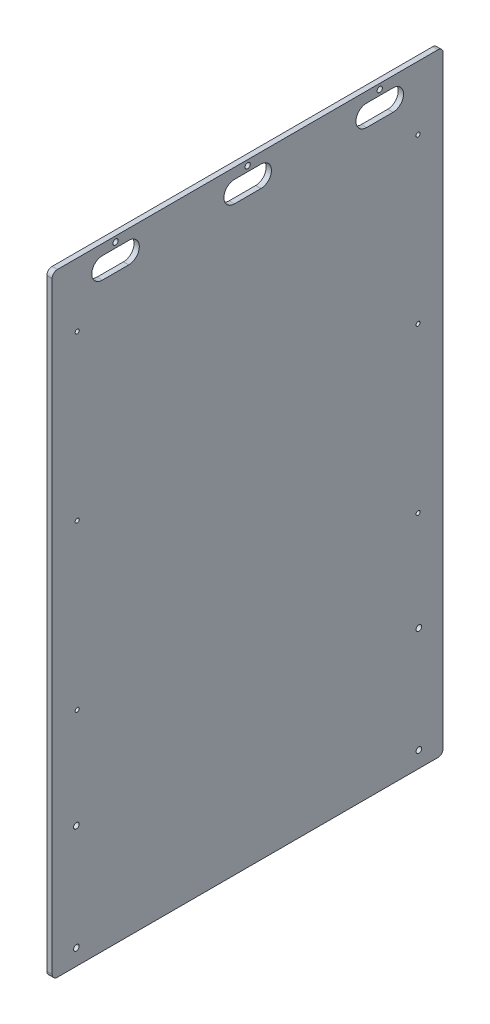
ISO-10303-21;
HEADER;
FILE_DESCRIPTION(('STEP AP214'),'2;1');
FILE_NAME('part.step','',(''),(''),'','','');
FILE_SCHEMA(('AUTOMOTIVE_DESIGN { 1 0 10303 214 1 1 1 1 }'));
ENDSEC;
DATA;
#1=APPLICATION_CONTEXT('core data for automotive mechanical design processes');
#2=APPLICATION_PROTOCOL_DEFINITION('international standard','automotive_design',2000,#1);
#3=PRODUCT_CONTEXT('',#1,'mechanical');
#4=PRODUCT('Part','Part','',(#3));
#5=PRODUCT_RELATED_PRODUCT_CATEGORY('part','',(#4));
#6=PRODUCT_DEFINITION_FORMATION('','',#4);
#7=PRODUCT_DEFINITION_CONTEXT('part definition',#1,'design');
#8=PRODUCT_DEFINITION('design','',#6,#7);
#9=PRODUCT_DEFINITION_SHAPE('','',#8);
#10=(LENGTH_UNIT() NAMED_UNIT(*) SI_UNIT(.MILLI.,.METRE.));
#11=(NAMED_UNIT(*) PLANE_ANGLE_UNIT() SI_UNIT($,.RADIAN.));
#12=(NAMED_UNIT(*) SI_UNIT($,.STERADIAN.) SOLID_ANGLE_UNIT());
#13=UNCERTAINTY_MEASURE_WITH_UNIT(LENGTH_MEASURE(1.E-05),#10,'distance_accuracy_value','');
#14=(GEOMETRIC_REPRESENTATION_CONTEXT(3) GLOBAL_UNCERTAINTY_ASSIGNED_CONTEXT((#13)) GLOBAL_UNIT_ASSIGNED_CONTEXT((#10,
#11,#12)) REPRESENTATION_CONTEXT('',''));
#15=CARTESIAN_POINT('',(0.,0.,0.));
#16=DIRECTION('',(0.,0.,1.));
#17=DIRECTION('',(1.,0.,0.));
#18=AXIS2_PLACEMENT_3D('',#15,#16,#17);
#19=CARTESIAN_POINT('',(0.,0.,0.));
#20=DIRECTION('',(-1.,0.,0.));
#21=DIRECTION('',(0.,0.,1.));
#22=AXIS2_PLACEMENT_3D('',#19,#20,#21);
#23=PLANE('',#22);
#24=CARTESIAN_POINT('',(0.,361.95,158.75));
#25=DIRECTION('',(1.,0.,0.));
#26=DIRECTION('',(0.,0.,-1.));
#27=AXIS2_PLACEMENT_3D('',#24,#25,#26);
#28=CIRCLE('',#27,3.17499999999998);
#29=CARTESIAN_POINT('',(0.,361.95,155.575));
#30=VERTEX_POINT('',#29);
#31=EDGE_CURVE('E826',#30,#30,#28,.T.);
#32=ORIENTED_EDGE('',*,*,#31,.T.);
#33=EDGE_LOOP('',(#32));
#34=FACE_BOUND('',#33,.T.);
#35=CARTESIAN_POINT('',(0.,361.95,0.));
#36=DIRECTION('',(1.,0.,0.));
#37=DIRECTION('',(0.,0.,-1.));
#38=AXIS2_PLACEMENT_3D('',#35,#36,#37);
#39=CIRCLE('',#38,3.17499999999998);
#40=CARTESIAN_POINT('',(0.,361.95,-3.17499999999998));
#41=VERTEX_POINT('',#40);
#42=EDGE_CURVE('E836',#41,#41,#39,.T.);
#43=ORIENTED_EDGE('',*,*,#42,.T.);
#44=EDGE_LOOP('',(#43));
#45=FACE_BOUND('',#44,.T.);
#46=CARTESIAN_POINT('',(0.,361.95,-158.75));
#47=DIRECTION('',(1.,0.,0.));
#48=DIRECTION('',(0.,0.,-1.));
#49=AXIS2_PLACEMENT_3D('',#46,#47,#48);
#50=CIRCLE('',#49,3.17499999999998);
#51=CARTESIAN_POINT('',(0.,361.95,-161.925));
#52=VERTEX_POINT('',#51);
#53=EDGE_CURVE('E202',#52,#52,#50,.T.);
#54=ORIENTED_EDGE('',*,*,#53,.T.);
#55=EDGE_LOOP('',(#54));
#56=FACE_BOUND('',#55,.T.);
#57=CARTESIAN_POINT('',(0.,342.9,174.625));
#58=DIRECTION('',(1.,0.,0.));
#59=DIRECTION('',(0.,0.,-1.));
#60=AXIS2_PLACEMENT_3D('',#57,#58,#59);
#61=CIRCLE('',#60,12.7);
#62=CARTESIAN_POINT('',(0.,355.6,174.625));
#63=VERTEX_POINT('',#62);
#64=CARTESIAN_POINT('',(0.,330.2,174.625));
#65=VERTEX_POINT('',#64);
#66=EDGE_CURVE('E176',#63,#65,#61,.T.);
#67=ORIENTED_EDGE('',*,*,#66,.T.);
#68=DIRECTION('',(0.,0.,-1.));
#69=VECTOR('',#68,1.);
#70=CARTESIAN_POINT('',(0.,330.2,174.625));
#71=LINE('',#70,#69);
#72=CARTESIAN_POINT('',(0.,330.2,142.875));
#73=VERTEX_POINT('',#72);
#74=EDGE_CURVE('E188',#65,#73,#71,.T.);
#75=ORIENTED_EDGE('',*,*,#74,.T.);
#76=CARTESIAN_POINT('',(0.,342.9,142.875));
#77=DIRECTION('',(1.,0.,0.));
#78=DIRECTION('',(0.,0.,-1.));
#79=AXIS2_PLACEMENT_3D('',#76,#77,#78);
#80=CIRCLE('',#79,12.7);
#81=CARTESIAN_POINT('',(0.,355.6,142.875));
#82=VERTEX_POINT('',#81);
#83=EDGE_CURVE('E192',#73,#82,#80,.T.);
#84=ORIENTED_EDGE('',*,*,#83,.T.);
#85=DIRECTION('',(0.,0.,1.));
#86=VECTOR('',#85,1.);
#87=CARTESIAN_POINT('',(0.,355.6,174.625));
#88=LINE('',#87,#86);
#89=EDGE_CURVE('E184',#82,#63,#88,.T.);
#90=ORIENTED_EDGE('',*,*,#89,.T.);
#91=EDGE_LOOP('',(#67,#75,#84,#90));
#92=FACE_BOUND('',#91,.T.);
#93=CARTESIAN_POINT('',(0.,342.9,15.8750000000001));
#94=DIRECTION('',(1.,0.,0.));
#95=DIRECTION('',(0.,0.,-1.));
#96=AXIS2_PLACEMENT_3D('',#93,#94,#95);
#97=CIRCLE('',#96,12.7);
#98=CARTESIAN_POINT('',(0.,355.6,15.8750000000001));
#99=VERTEX_POINT('',#98);
#100=CARTESIAN_POINT('',(0.,330.2,15.8750000000001));
#101=VERTEX_POINT('',#100);
#102=EDGE_CURVE('E219',#99,#101,#97,.T.);
#103=ORIENTED_EDGE('',*,*,#102,.T.);
#104=DIRECTION('',(0.,0.,-1.));
#105=VECTOR('',#104,1.);
#106=CARTESIAN_POINT('',(0.,330.2,15.8750000000001));
#107=LINE('',#106,#105);
#108=CARTESIAN_POINT('',(0.,330.2,-15.8749999999999));
#109=VERTEX_POINT('',#108);
#110=EDGE_CURVE('E222',#101,#109,#107,.T.);
#111=ORIENTED_EDGE('',*,*,#110,.T.);
#112=CARTESIAN_POINT('',(0.,342.9,-15.8749999999999));
#113=DIRECTION('',(1.,0.,0.));
#114=DIRECTION('',(0.,0.,-1.));
#115=AXIS2_PLACEMENT_3D('',#112,#113,#114);
#116=CIRCLE('',#115,12.7);
#117=CARTESIAN_POINT('',(0.,355.6,-15.8749999999999));
#118=VERTEX_POINT('',#117);
#119=EDGE_CURVE('E226',#109,#118,#116,.T.);
#120=ORIENTED_EDGE('',*,*,#119,.T.);
#121=DIRECTION('',(0.,0.,1.));
#122=VECTOR('',#121,1.);
#123=CARTESIAN_POINT('',(0.,355.6,15.8750000000001));
#124=LINE('',#123,#122);
#125=EDGE_CURVE('E229',#118,#99,#124,.T.);
#126=ORIENTED_EDGE('',*,*,#125,.T.);
#127=EDGE_LOOP('',(#103,#111,#120,#126));
#128=FACE_BOUND('',#127,.T.);
#129=CARTESIAN_POINT('',(0.,342.9,-142.875));
#130=DIRECTION('',(1.,0.,0.));
#131=DIRECTION('',(0.,0.,-1.));
#132=AXIS2_PLACEMENT_3D('',#129,#130,#131);
#133=CIRCLE('',#132,12.7);
#134=CARTESIAN_POINT('',(0.,355.6,-142.875));
#135=VERTEX_POINT('',#134);
#136=CARTESIAN_POINT('',(0.,330.2,-142.875));
#137=VERTEX_POINT('',#136);
#138=EDGE_CURVE('E251',#135,#137,#133,.T.);
#139=ORIENTED_EDGE('',*,*,#138,.T.);
#140=DIRECTION('',(0.,0.,-1.));
#141=VECTOR('',#140,1.);
#142=CARTESIAN_POINT('',(0.,330.2,-142.875));
#143=LINE('',#142,#141);
#144=CARTESIAN_POINT('',(0.,330.2,-174.625));
#145=VERTEX_POINT('',#144);
#146=EDGE_CURVE('E254',#137,#145,#143,.T.);
#147=ORIENTED_EDGE('',*,*,#146,.T.);
#148=CARTESIAN_POINT('',(0.,342.9,-174.625));
#149=DIRECTION('',(1.,0.,0.));
#150=DIRECTION('',(0.,0.,-1.));
#151=AXIS2_PLACEMENT_3D('',#148,#149,#150);
#152=CIRCLE('',#151,12.7);
#153=CARTESIAN_POINT('',(0.,355.6,-174.625));
#154=VERTEX_POINT('',#153);
#155=EDGE_CURVE('E258',#145,#154,#152,.T.);
#156=ORIENTED_EDGE('',*,*,#155,.T.);
#157=DIRECTION('',(0.,0.,1.));
#158=VECTOR('',#157,1.);
#159=CARTESIAN_POINT('',(0.,355.6,-142.875));
#160=LINE('',#159,#158);
#161=EDGE_CURVE('E261',#154,#135,#160,.T.);
#162=ORIENTED_EDGE('',*,*,#161,.T.);
#163=EDGE_LOOP('',(#139,#147,#156,#162));
#164=FACE_BOUND('',#163,.T.);
#165=CARTESIAN_POINT('',(0.,-221.996,205.74));
#166=DIRECTION('',(1.,0.,0.));
#167=DIRECTION('',(0.,0.,-1.));
#168=AXIS2_PLACEMENT_3D('',#165,#166,#167);
#169=CIRCLE('',#168,3.3782);
#170=CARTESIAN_POINT('',(0.,-221.996,202.3618));
#171=VERTEX_POINT('',#170);
#172=EDGE_CURVE('E284',#171,#171,#169,.T.);
#173=ORIENTED_EDGE('',*,*,#172,.T.);
#174=EDGE_LOOP('',(#173));
#175=FACE_BOUND('',#174,.T.);
#176=CARTESIAN_POINT('',(0.,-348.996,205.74));
#177=DIRECTION('',(1.,0.,0.));
#178=DIRECTION('',(0.,0.,-1.));
#179=AXIS2_PLACEMENT_3D('',#176,#177,#178);
#180=CIRCLE('',#179,3.3782);
#181=CARTESIAN_POINT('',(0.,-348.996,202.3618));
#182=VERTEX_POINT('',#181);
#183=EDGE_CURVE('E290',#182,#182,#180,.T.);
#184=ORIENTED_EDGE('',*,*,#183,.T.);
#185=EDGE_LOOP('',(#184));
#186=FACE_BOUND('',#185,.T.);
#187=DIRECTION('',(0.,1.,0.));
#188=VECTOR('',#187,1.);
#189=CARTESIAN_POINT('',(0.,-368.3,-234.95));
#190=LINE('',#189,#188);
#191=CARTESIAN_POINT('',(0.,-361.95,-234.95));
#192=VERTEX_POINT('',#191);
#193=CARTESIAN_POINT('',(0.,361.95,-234.95));
#194=VERTEX_POINT('',#193);
#195=EDGE_CURVE('E341',#192,#194,#190,.T.);
#196=ORIENTED_EDGE('',*,*,#195,.F.);
#197=CARTESIAN_POINT('',(0.,-361.95,-228.6));
#198=DIRECTION('',(-1.,0.,0.));
#199=DIRECTION('',(0.,0.,1.));
#200=AXIS2_PLACEMENT_3D('',#197,#198,#199);
#201=CIRCLE('',#200,6.35);
#202=CARTESIAN_POINT('',(0.,-368.3,-228.6));
#203=VERTEX_POINT('',#202);
#204=EDGE_CURVE('E373',#192,#203,#201,.T.);
#205=ORIENTED_EDGE('',*,*,#204,.T.);
#206=DIRECTION('',(0.,0.,-1.));
#207=VECTOR('',#206,1.);
#208=CARTESIAN_POINT('',(0.,-368.3,234.95));
#209=LINE('',#208,#207);
#210=CARTESIAN_POINT('',(0.,-368.3,228.6));
#211=VERTEX_POINT('',#210);
#212=EDGE_CURVE('E346',#211,#203,#209,.T.);
#213=ORIENTED_EDGE('',*,*,#212,.F.);
#214=CARTESIAN_POINT('',(0.,-361.95,228.6));
#215=DIRECTION('',(-1.,0.,0.));
#216=DIRECTION('',(0.,0.,1.));
#217=AXIS2_PLACEMENT_3D('',#214,#215,#216);
#218=CIRCLE('',#217,6.35);
#219=CARTESIAN_POINT('',(0.,-361.95,234.95));
#220=VERTEX_POINT('',#219);
#221=EDGE_CURVE('E371',#211,#220,#218,.T.);
#222=ORIENTED_EDGE('',*,*,#221,.T.);
#223=DIRECTION('',(0.,-1.,0.));
#224=VECTOR('',#223,1.);
#225=CARTESIAN_POINT('',(0.,-368.3,234.95));
#226=LINE('',#225,#224);
#227=CARTESIAN_POINT('',(0.,361.95,234.95));
#228=VERTEX_POINT('',#227);
#229=EDGE_CURVE('E359',#228,#220,#226,.T.);
#230=ORIENTED_EDGE('',*,*,#229,.F.);
#231=CARTESIAN_POINT('',(0.,361.95,228.6));
#232=DIRECTION('',(-1.,0.,0.));
#233=DIRECTION('',(0.,0.,1.));
#234=AXIS2_PLACEMENT_3D('',#231,#232,#233);
#235=CIRCLE('',#234,6.35);
#236=CARTESIAN_POINT('',(0.,368.3,228.6));
#237=VERTEX_POINT('',#236);
#238=EDGE_CURVE('E369',#228,#237,#235,.T.);
#239=ORIENTED_EDGE('',*,*,#238,.T.);
#240=DIRECTION('',(0.,0.,1.));
#241=VECTOR('',#240,1.);
#242=CARTESIAN_POINT('',(0.,368.3,234.95));
#243=LINE('',#242,#241);
#244=CARTESIAN_POINT('',(0.,368.3,-228.6));
#245=VERTEX_POINT('',#244);
#246=EDGE_CURVE('E356',#245,#237,#243,.T.);
#247=ORIENTED_EDGE('',*,*,#246,.F.);
#248=CARTESIAN_POINT('',(0.,361.95,-228.6));
#249=DIRECTION('',(-1.,0.,0.));
#250=DIRECTION('',(0.,0.,1.));
#251=AXIS2_PLACEMENT_3D('',#248,#249,#250);
#252=CIRCLE('',#251,6.35);
#253=EDGE_CURVE('E367',#245,#194,#252,.T.);
#254=ORIENTED_EDGE('',*,*,#253,.T.);
#255=EDGE_LOOP('',(#196,#205,#213,#222,#230,#239,#247,#254));
#256=FACE_BOUND('',#255,.T.);
#257=CARTESIAN_POINT('',(0.,-101.854,-204.7875));
#258=DIRECTION('',(1.,0.,0.));
#259=DIRECTION('',(0.,0.,-1.));
#260=AXIS2_PLACEMENT_3D('',#257,#258,#259);
#261=CIRCLE('',#260,2.45745);
#262=CARTESIAN_POINT('',(0.,-101.854,-207.24495));
#263=VERTEX_POINT('',#262);
#264=EDGE_CURVE('E338',#263,#263,#261,.T.);
#265=ORIENTED_EDGE('',*,*,#264,.T.);
#266=EDGE_LOOP('',(#265));
#267=FACE_BOUND('',#266,.T.);
#268=CARTESIAN_POINT('',(0.,291.846,-204.7875));
#269=DIRECTION('',(1.,0.,0.));
#270=DIRECTION('',(0.,0.,-1.));
#271=AXIS2_PLACEMENT_3D('',#268,#269,#270);
#272=CIRCLE('',#271,2.45744999999997);
#273=CARTESIAN_POINT('',(0.,291.846,-207.24495));
#274=VERTEX_POINT('',#273);
#275=EDGE_CURVE('E332',#274,#274,#272,.T.);
#276=ORIENTED_EDGE('',*,*,#275,.T.);
#277=EDGE_LOOP('',(#276));
#278=FACE_BOUND('',#277,.T.);
#279=CARTESIAN_POINT('',(0.,94.9960000000001,-204.7875));
#280=DIRECTION('',(1.,0.,0.));
#281=DIRECTION('',(0.,0.,-1.));
#282=AXIS2_PLACEMENT_3D('',#279,#280,#281);
#283=CIRCLE('',#282,2.45745);
#284=CARTESIAN_POINT('',(0.,94.9960000000001,-207.24495));
#285=VERTEX_POINT('',#284);
#286=EDGE_CURVE('E326',#285,#285,#283,.T.);
#287=ORIENTED_EDGE('',*,*,#286,.T.);
#288=EDGE_LOOP('',(#287));
#289=FACE_BOUND('',#288,.T.);
#290=CARTESIAN_POINT('',(0.,-101.854,204.7875));
#291=DIRECTION('',(1.,0.,0.));
#292=DIRECTION('',(0.,0.,-1.));
#293=AXIS2_PLACEMENT_3D('',#290,#291,#292);
#294=CIRCLE('',#293,2.45745);
#295=CARTESIAN_POINT('',(0.,-101.854,202.33005));
#296=VERTEX_POINT('',#295);
#297=EDGE_CURVE('E320',#296,#296,#294,.T.);
#298=ORIENTED_EDGE('',*,*,#297,.T.);
#299=EDGE_LOOP('',(#298));
#300=FACE_BOUND('',#299,.T.);
#301=CARTESIAN_POINT('',(0.,94.9960000000001,204.7875));
#302=DIRECTION('',(1.,0.,0.));
#303=DIRECTION('',(0.,0.,-1.));
#304=AXIS2_PLACEMENT_3D('',#301,#302,#303);
#305=CIRCLE('',#304,2.45745);
#306=CARTESIAN_POINT('',(0.,94.9960000000001,202.33005));
#307=VERTEX_POINT('',#306);
#308=EDGE_CURVE('E314',#307,#307,#305,.T.);
#309=ORIENTED_EDGE('',*,*,#308,.T.);
#310=EDGE_LOOP('',(#309));
#311=FACE_BOUND('',#310,.T.);
#312=CARTESIAN_POINT('',(0.,291.846,204.7875));
#313=DIRECTION('',(1.,0.,0.));
#314=DIRECTION('',(0.,0.,-1.));
#315=AXIS2_PLACEMENT_3D('',#312,#313,#314);
#316=CIRCLE('',#315,2.45744999999997);
#317=CARTESIAN_POINT('',(0.,291.846,202.33005));
#318=VERTEX_POINT('',#317);
#319=EDGE_CURVE('E308',#318,#318,#316,.T.);
#320=ORIENTED_EDGE('',*,*,#319,.T.);
#321=EDGE_LOOP('',(#320));
#322=FACE_BOUND('',#321,.T.);
#323=CARTESIAN_POINT('',(0.,-348.996,-205.74));
#324=DIRECTION('',(1.,0.,0.));
#325=DIRECTION('',(0.,0.,-1.));
#326=AXIS2_PLACEMENT_3D('',#323,#324,#325);
#327=CIRCLE('',#326,3.3782);
#328=CARTESIAN_POINT('',(0.,-348.996,-209.1182));
#329=VERTEX_POINT('',#328);
#330=EDGE_CURVE('E302',#329,#329,#327,.T.);
#331=ORIENTED_EDGE('',*,*,#330,.T.);
#332=EDGE_LOOP('',(#331));
#333=FACE_BOUND('',#332,.T.);
#334=CARTESIAN_POINT('',(0.,-221.996,-205.74));
#335=DIRECTION('',(1.,0.,0.));
#336=DIRECTION('',(0.,0.,-1.));
#337=AXIS2_PLACEMENT_3D('',#334,#335,#336);
#338=CIRCLE('',#337,3.3782);
#339=CARTESIAN_POINT('',(0.,-221.996,-209.1182));
#340=VERTEX_POINT('',#339);
#341=EDGE_CURVE('E296',#340,#340,#338,.T.);
#342=ORIENTED_EDGE('',*,*,#341,.T.);
#343=EDGE_LOOP('',(#342));
#344=FACE_BOUND('',#343,.T.);
#345=ADVANCED_FACE('F34',(#34,#45,#56,#92,#128,#164,#175,#186,#256,#267,#278,#289,#300,#311,
#322,#333,#344),#23,.T.);
#346=CARTESIAN_POINT('',(6.35,-368.3,-234.95));
#347=DIRECTION('',(0.,0.,1.));
#348=DIRECTION('',(1.,0.,0.));
#349=AXIS2_PLACEMENT_3D('',#346,#347,#348);
#350=PLANE('',#349);
#351=DIRECTION('',(0.,1.,0.));
#352=VECTOR('',#351,1.);
#353=CARTESIAN_POINT('',(6.35,-368.3,-234.95));
#354=LINE('',#353,#352);
#355=CARTESIAN_POINT('',(6.35,-361.95,-234.95));
#356=VERTEX_POINT('',#355);
#357=CARTESIAN_POINT('',(6.35,361.95,-234.95));
#358=VERTEX_POINT('',#357);
#359=EDGE_CURVE('E342',#356,#358,#354,.T.);
#360=ORIENTED_EDGE('',*,*,#359,.F.);
#361=DIRECTION('',(-1.,0.,0.));
#362=VECTOR('',#361,1.);
#363=CARTESIAN_POINT('',(6.35,-361.95,-234.95));
#364=LINE('',#363,#362);
#365=EDGE_CURVE('E364',#356,#192,#364,.T.);
#366=ORIENTED_EDGE('',*,*,#365,.T.);
#367=ORIENTED_EDGE('',*,*,#195,.T.);
#368=DIRECTION('',(-1.,0.,0.));
#369=VECTOR('',#368,1.);
#370=CARTESIAN_POINT('',(6.35,361.95,-234.95));
#371=LINE('',#370,#369);
#372=EDGE_CURVE('E353',#194,#358,#371,.F.);
#373=ORIENTED_EDGE('',*,*,#372,.T.);
#374=EDGE_LOOP('',(#360,#366,#367,#373));
#375=FACE_BOUND('',#374,.T.);
#376=ADVANCED_FACE('F423',(#375),#350,.F.);
#377=CARTESIAN_POINT('',(6.35,368.3,234.95));
#378=DIRECTION('',(0.,-1.,0.));
#379=DIRECTION('',(0.,0.,-1.));
#380=AXIS2_PLACEMENT_3D('',#377,#378,#379);
#381=PLANE('',#380);
#382=ORIENTED_EDGE('',*,*,#246,.T.);
#383=DIRECTION('',(-1.,0.,0.));
#384=VECTOR('',#383,1.);
#385=CARTESIAN_POINT('',(6.35,368.3,228.6));
#386=LINE('',#385,#384);
#387=CARTESIAN_POINT('',(6.35,368.3,228.6));
#388=VERTEX_POINT('',#387);
#389=EDGE_CURVE('E11',#237,#388,#386,.F.);
#390=ORIENTED_EDGE('',*,*,#389,.T.);
#391=DIRECTION('',(0.,0.,1.));
#392=VECTOR('',#391,1.);
#393=CARTESIAN_POINT('',(6.35,368.3,234.95));
#394=LINE('',#393,#392);
#395=CARTESIAN_POINT('',(6.35,368.3,-228.6));
#396=VERTEX_POINT('',#395);
#397=EDGE_CURVE('E345',#396,#388,#394,.T.);
#398=ORIENTED_EDGE('',*,*,#397,.F.);
#399=DIRECTION('',(-1.,0.,0.));
#400=VECTOR('',#399,1.);
#401=CARTESIAN_POINT('',(6.35,368.3,-228.6));
#402=LINE('',#401,#400);
#403=EDGE_CURVE('E42',#396,#245,#402,.T.);
#404=ORIENTED_EDGE('',*,*,#403,.T.);
#405=EDGE_LOOP('',(#382,#390,#398,#404));
#406=FACE_BOUND('',#405,.T.);
#407=ADVANCED_FACE('F395',(#406),#381,.F.);
#408=CARTESIAN_POINT('',(6.35,-368.3,234.95));
#409=DIRECTION('',(0.,0.,-1.));
#410=DIRECTION('',(-1.,0.,0.));
#411=AXIS2_PLACEMENT_3D('',#408,#409,#410);
#412=PLANE('',#411);
#413=ORIENTED_EDGE('',*,*,#229,.T.);
#414=DIRECTION('',(-1.,0.,0.));
#415=VECTOR('',#414,1.);
#416=CARTESIAN_POINT('',(6.35,-361.95,234.95));
#417=LINE('',#416,#415);
#418=CARTESIAN_POINT('',(6.35,-361.95,234.95));
#419=VERTEX_POINT('',#418);
#420=EDGE_CURVE('E49',#220,#419,#417,.F.);
#421=ORIENTED_EDGE('',*,*,#420,.T.);
#422=DIRECTION('',(0.,-1.,0.));
#423=VECTOR('',#422,1.);
#424=CARTESIAN_POINT('',(6.35,-368.3,234.95));
#425=LINE('',#424,#423);
#426=CARTESIAN_POINT('',(6.35,361.95,234.95));
#427=VERTEX_POINT('',#426);
#428=EDGE_CURVE('E348',#427,#419,#425,.T.);
#429=ORIENTED_EDGE('',*,*,#428,.F.);
#430=DIRECTION('',(-1.,0.,0.));
#431=VECTOR('',#430,1.);
#432=CARTESIAN_POINT('',(6.35,361.95,234.95));
#433=LINE('',#432,#431);
#434=EDGE_CURVE('E387',#427,#228,#433,.T.);
#435=ORIENTED_EDGE('',*,*,#434,.T.);
#436=EDGE_LOOP('',(#413,#421,#429,#435));
#437=FACE_BOUND('',#436,.T.);
#438=ADVANCED_FACE('F406',(#437),#412,.F.);
#439=CARTESIAN_POINT('',(6.35,-368.3,234.95));
#440=DIRECTION('',(0.,1.,0.));
#441=DIRECTION('',(0.,0.,1.));
#442=AXIS2_PLACEMENT_3D('',#439,#440,#441);
#443=PLANE('',#442);
#444=ORIENTED_EDGE('',*,*,#212,.T.);
#445=DIRECTION('',(-1.,0.,0.));
#446=VECTOR('',#445,1.);
#447=CARTESIAN_POINT('',(6.35,-368.3,-228.6));
#448=LINE('',#447,#446);
#449=CARTESIAN_POINT('',(6.35,-368.3,-228.6));
#450=VERTEX_POINT('',#449);
#451=EDGE_CURVE('E378',#203,#450,#448,.F.);
#452=ORIENTED_EDGE('',*,*,#451,.T.);
#453=DIRECTION('',(0.,0.,-1.));
#454=VECTOR('',#453,1.);
#455=CARTESIAN_POINT('',(6.35,-368.3,234.95));
#456=LINE('',#455,#454);
#457=CARTESIAN_POINT('',(6.35,-368.3,228.6));
#458=VERTEX_POINT('',#457);
#459=EDGE_CURVE('E350',#458,#450,#456,.T.);
#460=ORIENTED_EDGE('',*,*,#459,.F.);
#461=DIRECTION('',(-1.,0.,0.));
#462=VECTOR('',#461,1.);
#463=CARTESIAN_POINT('',(6.35,-368.3,228.6));
#464=LINE('',#463,#462);
#465=EDGE_CURVE('E375',#458,#211,#464,.T.);
#466=ORIENTED_EDGE('',*,*,#465,.T.);
#467=EDGE_LOOP('',(#444,#452,#460,#466));
#468=FACE_BOUND('',#467,.T.);
#469=ADVANCED_FACE('F415',(#468),#443,.F.);
#470=CARTESIAN_POINT('',(6.35,0.,0.));
#471=DIRECTION('',(-1.,0.,0.));
#472=DIRECTION('',(0.,0.,1.));
#473=AXIS2_PLACEMENT_3D('',#470,#471,#472);
#474=PLANE('',#473);
#475=CARTESIAN_POINT('',(6.35,361.95,158.75));
#476=DIRECTION('',(1.,0.,0.));
#477=DIRECTION('',(0.,0.,-1.));
#478=AXIS2_PLACEMENT_3D('',#475,#476,#477);
#479=CIRCLE('',#478,3.17499999999998);
#480=CARTESIAN_POINT('',(6.35,361.95,155.575));
#481=VERTEX_POINT('',#480);
#482=EDGE_CURVE('E829',#481,#481,#479,.T.);
#483=ORIENTED_EDGE('',*,*,#482,.F.);
#484=EDGE_LOOP('',(#483));
#485=FACE_BOUND('',#484,.T.);
#486=CARTESIAN_POINT('',(6.35,361.95,0.));
#487=DIRECTION('',(1.,0.,0.));
#488=DIRECTION('',(0.,0.,-1.));
#489=AXIS2_PLACEMENT_3D('',#486,#487,#488);
#490=CIRCLE('',#489,3.17499999999998);
#491=CARTESIAN_POINT('',(6.35,361.95,-3.17499999999998));
#492=VERTEX_POINT('',#491);
#493=EDGE_CURVE('E831',#492,#492,#490,.T.);
#494=ORIENTED_EDGE('',*,*,#493,.F.);
#495=EDGE_LOOP('',(#494));
#496=FACE_BOUND('',#495,.T.);
#497=CARTESIAN_POINT('',(6.35,361.95,-158.75));
#498=DIRECTION('',(1.,0.,0.));
#499=DIRECTION('',(0.,0.,-1.));
#500=AXIS2_PLACEMENT_3D('',#497,#498,#499);
#501=CIRCLE('',#500,3.17499999999998);
#502=CARTESIAN_POINT('',(6.35,361.95,-161.925));
#503=VERTEX_POINT('',#502);
#504=EDGE_CURVE('E838',#503,#503,#501,.T.);
#505=ORIENTED_EDGE('',*,*,#504,.F.);
#506=EDGE_LOOP('',(#505));
#507=FACE_BOUND('',#506,.T.);
#508=DIRECTION('',(0.,0.,-1.));
#509=VECTOR('',#508,1.);
#510=CARTESIAN_POINT('',(6.35,330.2,174.625));
#511=LINE('',#510,#509);
#512=CARTESIAN_POINT('',(6.35,330.2,174.625));
#513=VERTEX_POINT('',#512);
#514=CARTESIAN_POINT('',(6.35,330.2,142.875));
#515=VERTEX_POINT('',#514);
#516=EDGE_CURVE('E208',#513,#515,#511,.T.);
#517=ORIENTED_EDGE('',*,*,#516,.F.);
#518=CARTESIAN_POINT('',(6.35,342.9,174.625));
#519=DIRECTION('',(1.,0.,0.));
#520=DIRECTION('',(0.,0.,-1.));
#521=AXIS2_PLACEMENT_3D('',#518,#519,#520);
#522=CIRCLE('',#521,12.7);
#523=CARTESIAN_POINT('',(6.35,355.6,174.625));
#524=VERTEX_POINT('',#523);
#525=EDGE_CURVE('E179',#524,#513,#522,.T.);
#526=ORIENTED_EDGE('',*,*,#525,.F.);
#527=DIRECTION('',(0.,0.,1.));
#528=VECTOR('',#527,1.);
#529=CARTESIAN_POINT('',(6.35,355.6,174.625));
#530=LINE('',#529,#528);
#531=CARTESIAN_POINT('',(6.35,355.6,142.875));
#532=VERTEX_POINT('',#531);
#533=EDGE_CURVE('E196',#532,#524,#530,.T.);
#534=ORIENTED_EDGE('',*,*,#533,.F.);
#535=CARTESIAN_POINT('',(6.35,342.9,142.875));
#536=DIRECTION('',(1.,0.,0.));
#537=DIRECTION('',(0.,0.,-1.));
#538=AXIS2_PLACEMENT_3D('',#535,#536,#537);
#539=CIRCLE('',#538,12.7);
#540=EDGE_CURVE('E199',#515,#532,#539,.T.);
#541=ORIENTED_EDGE('',*,*,#540,.F.);
#542=EDGE_LOOP('',(#517,#526,#534,#541));
#543=FACE_BOUND('',#542,.T.);
#544=DIRECTION('',(0.,0.,-1.));
#545=VECTOR('',#544,1.);
#546=CARTESIAN_POINT('',(6.35,330.2,15.8750000000001));
#547=LINE('',#546,#545);
#548=CARTESIAN_POINT('',(6.35,330.2,15.8750000000001));
#549=VERTEX_POINT('',#548);
#550=CARTESIAN_POINT('',(6.35,330.2,-15.8749999999999));
#551=VERTEX_POINT('',#550);
#552=EDGE_CURVE('E235',#549,#551,#547,.T.);
#553=ORIENTED_EDGE('',*,*,#552,.F.);
#554=CARTESIAN_POINT('',(6.35,342.9,15.8750000000001));
#555=DIRECTION('',(1.,0.,0.));
#556=DIRECTION('',(0.,0.,-1.));
#557=AXIS2_PLACEMENT_3D('',#554,#555,#556);
#558=CIRCLE('',#557,12.7);
#559=CARTESIAN_POINT('',(6.35,355.6,15.8750000000001));
#560=VERTEX_POINT('',#559);
#561=EDGE_CURVE('E233',#560,#549,#558,.T.);
#562=ORIENTED_EDGE('',*,*,#561,.F.);
#563=DIRECTION('',(0.,0.,1.));
#564=VECTOR('',#563,1.);
#565=CARTESIAN_POINT('',(6.35,355.6,15.8750000000001));
#566=LINE('',#565,#564);
#567=CARTESIAN_POINT('',(6.35,355.6,-15.8749999999999));
#568=VERTEX_POINT('',#567);
#569=EDGE_CURVE('E223',#568,#560,#566,.T.);
#570=ORIENTED_EDGE('',*,*,#569,.F.);
#571=CARTESIAN_POINT('',(6.35,342.9,-15.8749999999999));
#572=DIRECTION('',(1.,0.,0.));
#573=DIRECTION('',(0.,0.,-1.));
#574=AXIS2_PLACEMENT_3D('',#571,#572,#573);
#575=CIRCLE('',#574,12.7);
#576=EDGE_CURVE('E239',#551,#568,#575,.T.);
#577=ORIENTED_EDGE('',*,*,#576,.F.);
#578=EDGE_LOOP('',(#553,#562,#570,#577));
#579=FACE_BOUND('',#578,.T.);
#580=DIRECTION('',(0.,0.,-1.));
#581=VECTOR('',#580,1.);
#582=CARTESIAN_POINT('',(6.35,330.2,-142.875));
#583=LINE('',#582,#581);
#584=CARTESIAN_POINT('',(6.35,330.2,-142.875));
#585=VERTEX_POINT('',#584);
#586=CARTESIAN_POINT('',(6.35,330.2,-174.625));
#587=VERTEX_POINT('',#586);
#588=EDGE_CURVE('E267',#585,#587,#583,.T.);
#589=ORIENTED_EDGE('',*,*,#588,.F.);
#590=CARTESIAN_POINT('',(6.35,342.9,-142.875));
#591=DIRECTION('',(1.,0.,0.));
#592=DIRECTION('',(0.,0.,-1.));
#593=AXIS2_PLACEMENT_3D('',#590,#591,#592);
#594=CIRCLE('',#593,12.7);
#595=CARTESIAN_POINT('',(6.35,355.6,-142.875));
#596=VERTEX_POINT('',#595);
#597=EDGE_CURVE('E265',#596,#585,#594,.T.);
#598=ORIENTED_EDGE('',*,*,#597,.F.);
#599=DIRECTION('',(0.,0.,1.));
#600=VECTOR('',#599,1.);
#601=CARTESIAN_POINT('',(6.35,355.6,-142.875));
#602=LINE('',#601,#600);
#603=CARTESIAN_POINT('',(6.35,355.6,-174.625));
#604=VERTEX_POINT('',#603);
#605=EDGE_CURVE('E255',#604,#596,#602,.T.);
#606=ORIENTED_EDGE('',*,*,#605,.F.);
#607=CARTESIAN_POINT('',(6.35,342.9,-174.625));
#608=DIRECTION('',(1.,0.,0.));
#609=DIRECTION('',(0.,0.,-1.));
#610=AXIS2_PLACEMENT_3D('',#607,#608,#609);
#611=CIRCLE('',#610,12.7);
#612=EDGE_CURVE('E270',#587,#604,#611,.T.);
#613=ORIENTED_EDGE('',*,*,#612,.F.);
#614=EDGE_LOOP('',(#589,#598,#606,#613));
#615=FACE_BOUND('',#614,.T.);
#616=CARTESIAN_POINT('',(6.35,-221.996,205.74));
#617=DIRECTION('',(1.,0.,0.));
#618=DIRECTION('',(0.,0.,-1.));
#619=AXIS2_PLACEMENT_3D('',#616,#617,#618);
#620=CIRCLE('',#619,3.3782);
#621=CARTESIAN_POINT('',(6.35,-221.996,202.3618));
#622=VERTEX_POINT('',#621);
#623=EDGE_CURVE('E215',#622,#622,#620,.T.);
#624=ORIENTED_EDGE('',*,*,#623,.F.);
#625=EDGE_LOOP('',(#624));
#626=FACE_BOUND('',#625,.T.);
#627=CARTESIAN_POINT('',(6.35,-348.996,205.74));
#628=DIRECTION('',(1.,0.,0.));
#629=DIRECTION('',(0.,0.,-1.));
#630=AXIS2_PLACEMENT_3D('',#627,#628,#629);
#631=CIRCLE('',#630,3.3782);
#632=CARTESIAN_POINT('',(6.35,-348.996,202.3618));
#633=VERTEX_POINT('',#632);
#634=EDGE_CURVE('E287',#633,#633,#631,.T.);
#635=ORIENTED_EDGE('',*,*,#634,.F.);
#636=EDGE_LOOP('',(#635));
#637=FACE_BOUND('',#636,.T.);
#638=CARTESIAN_POINT('',(6.35,-221.996,-205.74));
#639=DIRECTION('',(1.,0.,0.));
#640=DIRECTION('',(0.,0.,-1.));
#641=AXIS2_PLACEMENT_3D('',#638,#639,#640);
#642=CIRCLE('',#641,3.3782);
#643=CARTESIAN_POINT('',(6.35,-221.996,-209.1182));
#644=VERTEX_POINT('',#643);
#645=EDGE_CURVE('E293',#644,#644,#642,.T.);
#646=ORIENTED_EDGE('',*,*,#645,.F.);
#647=EDGE_LOOP('',(#646));
#648=FACE_BOUND('',#647,.T.);
#649=CARTESIAN_POINT('',(6.35,-348.996,-205.74));
#650=DIRECTION('',(1.,0.,0.));
#651=DIRECTION('',(0.,0.,-1.));
#652=AXIS2_PLACEMENT_3D('',#649,#650,#651);
#653=CIRCLE('',#652,3.3782);
#654=CARTESIAN_POINT('',(6.35,-348.996,-209.1182));
#655=VERTEX_POINT('',#654);
#656=EDGE_CURVE('E299',#655,#655,#653,.T.);
#657=ORIENTED_EDGE('',*,*,#656,.F.);
#658=EDGE_LOOP('',(#657));
#659=FACE_BOUND('',#658,.T.);
#660=CARTESIAN_POINT('',(6.35,291.846,204.7875));
#661=DIRECTION('',(1.,0.,0.));
#662=DIRECTION('',(0.,0.,-1.));
#663=AXIS2_PLACEMENT_3D('',#660,#661,#662);
#664=CIRCLE('',#663,2.45744999999997);
#665=CARTESIAN_POINT('',(6.35,291.846,202.33005));
#666=VERTEX_POINT('',#665);
#667=EDGE_CURVE('E305',#666,#666,#664,.T.);
#668=ORIENTED_EDGE('',*,*,#667,.F.);
#669=EDGE_LOOP('',(#668));
#670=FACE_BOUND('',#669,.T.);
#671=CARTESIAN_POINT('',(6.35,94.9960000000001,204.7875));
#672=DIRECTION('',(1.,0.,0.));
#673=DIRECTION('',(0.,0.,-1.));
#674=AXIS2_PLACEMENT_3D('',#671,#672,#673);
#675=CIRCLE('',#674,2.45744999999999);
#676=CARTESIAN_POINT('',(6.35,94.9960000000001,202.33005));
#677=VERTEX_POINT('',#676);
#678=EDGE_CURVE('E311',#677,#677,#675,.T.);
#679=ORIENTED_EDGE('',*,*,#678,.F.);
#680=EDGE_LOOP('',(#679));
#681=FACE_BOUND('',#680,.T.);
#682=CARTESIAN_POINT('',(6.35,-101.854,204.7875));
#683=DIRECTION('',(1.,0.,0.));
#684=DIRECTION('',(0.,0.,-1.));
#685=AXIS2_PLACEMENT_3D('',#682,#683,#684);
#686=CIRCLE('',#685,2.45744999999999);
#687=CARTESIAN_POINT('',(6.35,-101.854,202.33005));
#688=VERTEX_POINT('',#687);
#689=EDGE_CURVE('E317',#688,#688,#686,.T.);
#690=ORIENTED_EDGE('',*,*,#689,.F.);
#691=EDGE_LOOP('',(#690));
#692=FACE_BOUND('',#691,.T.);
#693=CARTESIAN_POINT('',(6.35,94.9960000000001,-204.7875));
#694=DIRECTION('',(1.,0.,0.));
#695=DIRECTION('',(0.,0.,-1.));
#696=AXIS2_PLACEMENT_3D('',#693,#694,#695);
#697=CIRCLE('',#696,2.45744999999999);
#698=CARTESIAN_POINT('',(6.35,94.9960000000001,-207.24495));
#699=VERTEX_POINT('',#698);
#700=EDGE_CURVE('E323',#699,#699,#697,.T.);
#701=ORIENTED_EDGE('',*,*,#700,.F.);
#702=EDGE_LOOP('',(#701));
#703=FACE_BOUND('',#702,.T.);
#704=CARTESIAN_POINT('',(6.35,291.846,-204.7875));
#705=DIRECTION('',(1.,0.,0.));
#706=DIRECTION('',(0.,0.,-1.));
#707=AXIS2_PLACEMENT_3D('',#704,#705,#706);
#708=CIRCLE('',#707,2.45744999999997);
#709=CARTESIAN_POINT('',(6.35,291.846,-207.24495));
#710=VERTEX_POINT('',#709);
#711=EDGE_CURVE('E329',#710,#710,#708,.T.);
#712=ORIENTED_EDGE('',*,*,#711,.F.);
#713=EDGE_LOOP('',(#712));
#714=FACE_BOUND('',#713,.T.);
#715=CARTESIAN_POINT('',(6.35,-101.854,-204.7875));
#716=DIRECTION('',(1.,0.,0.));
#717=DIRECTION('',(0.,0.,-1.));
#718=AXIS2_PLACEMENT_3D('',#715,#716,#717);
#719=CIRCLE('',#718,2.45744999999999);
#720=CARTESIAN_POINT('',(6.35,-101.854,-207.24495));
#721=VERTEX_POINT('',#720);
#722=EDGE_CURVE('E335',#721,#721,#719,.T.);
#723=ORIENTED_EDGE('',*,*,#722,.F.);
#724=EDGE_LOOP('',(#723));
#725=FACE_BOUND('',#724,.T.);
#726=ORIENTED_EDGE('',*,*,#459,.T.);
#727=CARTESIAN_POINT('',(6.35,-361.95,-228.6));
#728=DIRECTION('',(-1.,0.,0.));
#729=DIRECTION('',(0.,0.,1.));
#730=AXIS2_PLACEMENT_3D('',#727,#728,#729);
#731=CIRCLE('',#730,6.35);
#732=EDGE_CURVE('E385',#450,#356,#731,.F.);
#733=ORIENTED_EDGE('',*,*,#732,.T.);
#734=ORIENTED_EDGE('',*,*,#359,.T.);
#735=CARTESIAN_POINT('',(6.35,361.95,-228.6));
#736=DIRECTION('',(-1.,0.,0.));
#737=DIRECTION('',(0.,0.,1.));
#738=AXIS2_PLACEMENT_3D('',#735,#736,#737);
#739=CIRCLE('',#738,6.35);
#740=EDGE_CURVE('E380',#358,#396,#739,.F.);
#741=ORIENTED_EDGE('',*,*,#740,.T.);
#742=ORIENTED_EDGE('',*,*,#397,.T.);
#743=CARTESIAN_POINT('',(6.35,361.95,228.6));
#744=DIRECTION('',(-1.,0.,0.));
#745=DIRECTION('',(0.,0.,1.));
#746=AXIS2_PLACEMENT_3D('',#743,#744,#745);
#747=CIRCLE('',#746,6.35);
#748=EDGE_CURVE('E56',#388,#427,#747,.F.);
#749=ORIENTED_EDGE('',*,*,#748,.T.);
#750=ORIENTED_EDGE('',*,*,#428,.T.);
#751=CARTESIAN_POINT('',(6.35,-361.95,228.6));
#752=DIRECTION('',(-1.,0.,0.));
#753=DIRECTION('',(0.,0.,1.));
#754=AXIS2_PLACEMENT_3D('',#751,#752,#753);
#755=CIRCLE('',#754,6.35);
#756=EDGE_CURVE('E383',#419,#458,#755,.F.);
#757=ORIENTED_EDGE('',*,*,#756,.T.);
#758=EDGE_LOOP('',(#726,#733,#734,#741,#742,#749,#750,#757));
#759=FACE_BOUND('',#758,.T.);
#760=ADVANCED_FACE('F408',(#485,#496,#507,#543,#579,#615,#626,#637,#648,#659,#670,#681,#692,
#703,#714,#725,#759),#474,.F.);
#761=CARTESIAN_POINT('',(6.35,-101.854,-204.7875));
#762=DIRECTION('',(1.,0.,0.));
#763=DIRECTION('',(0.,0.,-1.));
#764=AXIS2_PLACEMENT_3D('',#761,#762,#763);
#765=CYLINDRICAL_SURFACE('',#764,2.45744999999999);
#766=ORIENTED_EDGE('',*,*,#264,.F.);
#767=EDGE_LOOP('',(#766));
#768=FACE_BOUND('',#767,.T.);
#769=ORIENTED_EDGE('',*,*,#722,.T.);
#770=EDGE_LOOP('',(#769));
#771=FACE_BOUND('',#770,.T.);
#772=ADVANCED_FACE('F484',(#768,#771),#765,.F.);
#773=CARTESIAN_POINT('',(6.35,291.846,-204.7875));
#774=DIRECTION('',(1.,0.,0.));
#775=DIRECTION('',(0.,0.,-1.));
#776=AXIS2_PLACEMENT_3D('',#773,#774,#775);
#777=CYLINDRICAL_SURFACE('',#776,2.45744999999997);
#778=ORIENTED_EDGE('',*,*,#275,.F.);
#779=EDGE_LOOP('',(#778));
#780=FACE_BOUND('',#779,.T.);
#781=ORIENTED_EDGE('',*,*,#711,.T.);
#782=EDGE_LOOP('',(#781));
#783=FACE_BOUND('',#782,.T.);
#784=ADVANCED_FACE('F592',(#780,#783),#777,.F.);
#785=CARTESIAN_POINT('',(6.35,94.9960000000001,-204.7875));
#786=DIRECTION('',(1.,0.,0.));
#787=DIRECTION('',(0.,0.,-1.));
#788=AXIS2_PLACEMENT_3D('',#785,#786,#787);
#789=CYLINDRICAL_SURFACE('',#788,2.45744999999999);
#790=ORIENTED_EDGE('',*,*,#286,.F.);
#791=EDGE_LOOP('',(#790));
#792=FACE_BOUND('',#791,.T.);
#793=ORIENTED_EDGE('',*,*,#700,.T.);
#794=EDGE_LOOP('',(#793));
#795=FACE_BOUND('',#794,.T.);
#796=ADVANCED_FACE('F588',(#792,#795),#789,.F.);
#797=CARTESIAN_POINT('',(6.35,-101.854,204.7875));
#798=DIRECTION('',(1.,0.,0.));
#799=DIRECTION('',(0.,0.,-1.));
#800=AXIS2_PLACEMENT_3D('',#797,#798,#799);
#801=CYLINDRICAL_SURFACE('',#800,2.45744999999999);
#802=ORIENTED_EDGE('',*,*,#297,.F.);
#803=EDGE_LOOP('',(#802));
#804=FACE_BOUND('',#803,.T.);
#805=ORIENTED_EDGE('',*,*,#689,.T.);
#806=EDGE_LOOP('',(#805));
#807=FACE_BOUND('',#806,.T.);
#808=ADVANCED_FACE('F584',(#804,#807),#801,.F.);
#809=CARTESIAN_POINT('',(6.35,94.9960000000001,204.7875));
#810=DIRECTION('',(1.,0.,0.));
#811=DIRECTION('',(0.,0.,-1.));
#812=AXIS2_PLACEMENT_3D('',#809,#810,#811);
#813=CYLINDRICAL_SURFACE('',#812,2.45744999999999);
#814=ORIENTED_EDGE('',*,*,#308,.F.);
#815=EDGE_LOOP('',(#814));
#816=FACE_BOUND('',#815,.T.);
#817=ORIENTED_EDGE('',*,*,#678,.T.);
#818=EDGE_LOOP('',(#817));
#819=FACE_BOUND('',#818,.T.);
#820=ADVANCED_FACE('F580',(#816,#819),#813,.F.);
#821=CARTESIAN_POINT('',(6.35,291.846,204.7875));
#822=DIRECTION('',(1.,0.,0.));
#823=DIRECTION('',(0.,0.,-1.));
#824=AXIS2_PLACEMENT_3D('',#821,#822,#823);
#825=CYLINDRICAL_SURFACE('',#824,2.45744999999997);
#826=ORIENTED_EDGE('',*,*,#319,.F.);
#827=EDGE_LOOP('',(#826));
#828=FACE_BOUND('',#827,.T.);
#829=ORIENTED_EDGE('',*,*,#667,.T.);
#830=EDGE_LOOP('',(#829));
#831=FACE_BOUND('',#830,.T.);
#832=ADVANCED_FACE('F576',(#828,#831),#825,.F.);
#833=CARTESIAN_POINT('',(6.35,-348.996,-205.74));
#834=DIRECTION('',(1.,0.,0.));
#835=DIRECTION('',(0.,0.,-1.));
#836=AXIS2_PLACEMENT_3D('',#833,#834,#835);
#837=CYLINDRICAL_SURFACE('',#836,3.3782);
#838=ORIENTED_EDGE('',*,*,#330,.F.);
#839=EDGE_LOOP('',(#838));
#840=FACE_BOUND('',#839,.T.);
#841=ORIENTED_EDGE('',*,*,#656,.T.);
#842=EDGE_LOOP('',(#841));
#843=FACE_BOUND('',#842,.T.);
#844=ADVANCED_FACE('F572',(#840,#843),#837,.F.);
#845=CARTESIAN_POINT('',(6.35,-221.996,-205.74));
#846=DIRECTION('',(1.,0.,0.));
#847=DIRECTION('',(0.,0.,-1.));
#848=AXIS2_PLACEMENT_3D('',#845,#846,#847);
#849=CYLINDRICAL_SURFACE('',#848,3.3782);
#850=ORIENTED_EDGE('',*,*,#341,.F.);
#851=EDGE_LOOP('',(#850));
#852=FACE_BOUND('',#851,.T.);
#853=ORIENTED_EDGE('',*,*,#645,.T.);
#854=EDGE_LOOP('',(#853));
#855=FACE_BOUND('',#854,.T.);
#856=ADVANCED_FACE('F568',(#852,#855),#849,.F.);
#857=CARTESIAN_POINT('',(6.35,-348.996,205.74));
#858=DIRECTION('',(1.,0.,0.));
#859=DIRECTION('',(0.,0.,-1.));
#860=AXIS2_PLACEMENT_3D('',#857,#858,#859);
#861=CYLINDRICAL_SURFACE('',#860,3.3782);
#862=ORIENTED_EDGE('',*,*,#183,.F.);
#863=EDGE_LOOP('',(#862));
#864=FACE_BOUND('',#863,.T.);
#865=ORIENTED_EDGE('',*,*,#634,.T.);
#866=EDGE_LOOP('',(#865));
#867=FACE_BOUND('',#866,.T.);
#868=ADVANCED_FACE('F564',(#864,#867),#861,.F.);
#869=CARTESIAN_POINT('',(6.35,-221.996,205.74));
#870=DIRECTION('',(1.,0.,0.));
#871=DIRECTION('',(0.,0.,-1.));
#872=AXIS2_PLACEMENT_3D('',#869,#870,#871);
#873=CYLINDRICAL_SURFACE('',#872,3.3782);
#874=ORIENTED_EDGE('',*,*,#172,.F.);
#875=EDGE_LOOP('',(#874));
#876=FACE_BOUND('',#875,.T.);
#877=ORIENTED_EDGE('',*,*,#623,.T.);
#878=EDGE_LOOP('',(#877));
#879=FACE_BOUND('',#878,.T.);
#880=ADVANCED_FACE('F560',(#876,#879),#873,.F.);
#881=CARTESIAN_POINT('',(0.,342.9,-142.875));
#882=DIRECTION('',(1.,0.,0.));
#883=DIRECTION('',(0.,0.,-1.));
#884=AXIS2_PLACEMENT_3D('',#881,#882,#883);
#885=CYLINDRICAL_SURFACE('',#884,12.7);
#886=ORIENTED_EDGE('',*,*,#597,.T.);
#887=DIRECTION('',(1.,0.,0.));
#888=VECTOR('',#887,1.);
#889=CARTESIAN_POINT('',(0.,330.2,-142.875));
#890=LINE('',#889,#888);
#891=EDGE_CURVE('E264',#137,#585,#890,.T.);
#892=ORIENTED_EDGE('',*,*,#891,.F.);
#893=ORIENTED_EDGE('',*,*,#138,.F.);
#894=DIRECTION('',(1.,0.,0.));
#895=VECTOR('',#894,1.);
#896=CARTESIAN_POINT('',(0.,355.6,-142.875));
#897=LINE('',#896,#895);
#898=EDGE_CURVE('E236',#135,#596,#897,.T.);
#899=ORIENTED_EDGE('',*,*,#898,.T.);
#900=EDGE_LOOP('',(#886,#892,#893,#899));
#901=FACE_BOUND('',#900,.T.);
#902=ADVANCED_FACE('F550',(#901),#885,.F.);
#903=CARTESIAN_POINT('',(0.,355.6,-142.875));
#904=DIRECTION('',(0.,1.,0.));
#905=DIRECTION('',(0.,0.,1.));
#906=AXIS2_PLACEMENT_3D('',#903,#904,#905);
#907=PLANE('',#906);
#908=ORIENTED_EDGE('',*,*,#605,.T.);
#909=ORIENTED_EDGE('',*,*,#898,.F.);
#910=ORIENTED_EDGE('',*,*,#161,.F.);
#911=DIRECTION('',(1.,0.,0.));
#912=VECTOR('',#911,1.);
#913=CARTESIAN_POINT('',(0.,355.6,-174.625));
#914=LINE('',#913,#912);
#915=EDGE_CURVE('E276',#154,#604,#914,.T.);
#916=ORIENTED_EDGE('',*,*,#915,.T.);
#917=EDGE_LOOP('',(#908,#909,#910,#916));
#918=FACE_BOUND('',#917,.T.);
#919=ADVANCED_FACE('F546',(#918),#907,.F.);
#920=CARTESIAN_POINT('',(0.,342.9,-174.625));
#921=DIRECTION('',(1.,0.,0.));
#922=DIRECTION('',(0.,0.,-1.));
#923=AXIS2_PLACEMENT_3D('',#920,#921,#922);
#924=CYLINDRICAL_SURFACE('',#923,12.7);
#925=ORIENTED_EDGE('',*,*,#612,.T.);
#926=ORIENTED_EDGE('',*,*,#915,.F.);
#927=ORIENTED_EDGE('',*,*,#155,.F.);
#928=DIRECTION('',(1.,0.,0.));
#929=VECTOR('',#928,1.);
#930=CARTESIAN_POINT('',(0.,330.2,-174.625));
#931=LINE('',#930,#929);
#932=EDGE_CURVE('E278',#145,#587,#931,.T.);
#933=ORIENTED_EDGE('',*,*,#932,.T.);
#934=EDGE_LOOP('',(#925,#926,#927,#933));
#935=FACE_BOUND('',#934,.T.);
#936=ADVANCED_FACE('F549',(#935),#924,.F.);
#937=CARTESIAN_POINT('',(0.,330.2,-142.875));
#938=DIRECTION('',(0.,-1.,0.));
#939=DIRECTION('',(0.,0.,-1.));
#940=AXIS2_PLACEMENT_3D('',#937,#938,#939);
#941=PLANE('',#940);
#942=ORIENTED_EDGE('',*,*,#588,.T.);
#943=ORIENTED_EDGE('',*,*,#932,.F.);
#944=ORIENTED_EDGE('',*,*,#146,.F.);
#945=ORIENTED_EDGE('',*,*,#891,.T.);
#946=EDGE_LOOP('',(#942,#943,#944,#945));
#947=FACE_BOUND('',#946,.T.);
#948=ADVANCED_FACE('F544',(#947),#941,.F.);
#949=CARTESIAN_POINT('',(0.,342.9,15.8750000000001));
#950=DIRECTION('',(1.,0.,0.));
#951=DIRECTION('',(0.,0.,-1.));
#952=AXIS2_PLACEMENT_3D('',#949,#950,#951);
#953=CYLINDRICAL_SURFACE('',#952,12.7);
#954=ORIENTED_EDGE('',*,*,#561,.T.);
#955=DIRECTION('',(1.,0.,0.));
#956=VECTOR('',#955,1.);
#957=CARTESIAN_POINT('',(0.,330.2,15.8750000000001));
#958=LINE('',#957,#956);
#959=EDGE_CURVE('E232',#101,#549,#958,.T.);
#960=ORIENTED_EDGE('',*,*,#959,.F.);
#961=ORIENTED_EDGE('',*,*,#102,.F.);
#962=DIRECTION('',(1.,0.,0.));
#963=VECTOR('',#962,1.);
#964=CARTESIAN_POINT('',(0.,355.6,15.8750000000001));
#965=LINE('',#964,#963);
#966=EDGE_CURVE('E209',#99,#560,#965,.T.);
#967=ORIENTED_EDGE('',*,*,#966,.T.);
#968=EDGE_LOOP('',(#954,#960,#961,#967));
#969=FACE_BOUND('',#968,.T.);
#970=ADVANCED_FACE('F534',(#969),#953,.F.);
#971=CARTESIAN_POINT('',(0.,355.6,15.8750000000001));
#972=DIRECTION('',(0.,1.,0.));
#973=DIRECTION('',(0.,0.,1.));
#974=AXIS2_PLACEMENT_3D('',#971,#972,#973);
#975=PLANE('',#974);
#976=ORIENTED_EDGE('',*,*,#569,.T.);
#977=ORIENTED_EDGE('',*,*,#966,.F.);
#978=ORIENTED_EDGE('',*,*,#125,.F.);
#979=DIRECTION('',(1.,0.,0.));
#980=VECTOR('',#979,1.);
#981=CARTESIAN_POINT('',(0.,355.6,-15.8749999999999));
#982=LINE('',#981,#980);
#983=EDGE_CURVE('E245',#118,#568,#982,.T.);
#984=ORIENTED_EDGE('',*,*,#983,.T.);
#985=EDGE_LOOP('',(#976,#977,#978,#984));
#986=FACE_BOUND('',#985,.T.);
#987=ADVANCED_FACE('F530',(#986),#975,.F.);
#988=CARTESIAN_POINT('',(0.,342.9,-15.8749999999999));
#989=DIRECTION('',(1.,0.,0.));
#990=DIRECTION('',(0.,0.,-1.));
#991=AXIS2_PLACEMENT_3D('',#988,#989,#990);
#992=CYLINDRICAL_SURFACE('',#991,12.7);
#993=ORIENTED_EDGE('',*,*,#576,.T.);
#994=ORIENTED_EDGE('',*,*,#983,.F.);
#995=ORIENTED_EDGE('',*,*,#119,.F.);
#996=DIRECTION('',(1.,0.,0.));
#997=VECTOR('',#996,1.);
#998=CARTESIAN_POINT('',(0.,330.2,-15.8749999999999));
#999=LINE('',#998,#997);
#1000=EDGE_CURVE('E247',#109,#551,#999,.T.);
#1001=ORIENTED_EDGE('',*,*,#1000,.T.);
#1002=EDGE_LOOP('',(#993,#994,#995,#1001));
#1003=FACE_BOUND('',#1002,.T.);
#1004=ADVANCED_FACE('F533',(#1003),#992,.F.);
#1005=CARTESIAN_POINT('',(0.,330.2,15.8750000000001));
#1006=DIRECTION('',(0.,-1.,0.));
#1007=DIRECTION('',(0.,0.,-1.));
#1008=AXIS2_PLACEMENT_3D('',#1005,#1006,#1007);
#1009=PLANE('',#1008);
#1010=ORIENTED_EDGE('',*,*,#552,.T.);
#1011=ORIENTED_EDGE('',*,*,#1000,.F.);
#1012=ORIENTED_EDGE('',*,*,#110,.F.);
#1013=ORIENTED_EDGE('',*,*,#959,.T.);
#1014=EDGE_LOOP('',(#1010,#1011,#1012,#1013));
#1015=FACE_BOUND('',#1014,.T.);
#1016=ADVANCED_FACE('F529',(#1015),#1009,.F.);
#1017=CARTESIAN_POINT('',(0.,342.9,174.625));
#1018=DIRECTION('',(1.,0.,0.));
#1019=DIRECTION('',(0.,0.,-1.));
#1020=AXIS2_PLACEMENT_3D('',#1017,#1018,#1019);
#1021=CYLINDRICAL_SURFACE('',#1020,12.7);
#1022=ORIENTED_EDGE('',*,*,#525,.T.);
#1023=DIRECTION('',(1.,0.,0.));
#1024=VECTOR('',#1023,1.);
#1025=CARTESIAN_POINT('',(0.,330.2,174.625));
#1026=LINE('',#1025,#1024);
#1027=EDGE_CURVE('E172',#65,#513,#1026,.T.);
#1028=ORIENTED_EDGE('',*,*,#1027,.F.);
#1029=ORIENTED_EDGE('',*,*,#66,.F.);
#1030=DIRECTION('',(1.,0.,0.));
#1031=VECTOR('',#1030,1.);
#1032=CARTESIAN_POINT('',(0.,355.6,174.625));
#1033=LINE('',#1032,#1031);
#1034=EDGE_CURVE('E213',#63,#524,#1033,.T.);
#1035=ORIENTED_EDGE('',*,*,#1034,.T.);
#1036=EDGE_LOOP('',(#1022,#1028,#1029,#1035));
#1037=FACE_BOUND('',#1036,.T.);
#1038=ADVANCED_FACE('F174',(#1037),#1021,.F.);
#1039=CARTESIAN_POINT('',(0.,355.6,174.625));
#1040=DIRECTION('',(0.,1.,0.));
#1041=DIRECTION('',(0.,0.,1.));
#1042=AXIS2_PLACEMENT_3D('',#1039,#1040,#1041);
#1043=PLANE('',#1042);
#1044=ORIENTED_EDGE('',*,*,#533,.T.);
#1045=ORIENTED_EDGE('',*,*,#1034,.F.);
#1046=ORIENTED_EDGE('',*,*,#89,.F.);
#1047=DIRECTION('',(1.,0.,0.));
#1048=VECTOR('',#1047,1.);
#1049=CARTESIAN_POINT('',(0.,355.6,142.875));
#1050=LINE('',#1049,#1048);
#1051=EDGE_CURVE('E216',#82,#532,#1050,.T.);
#1052=ORIENTED_EDGE('',*,*,#1051,.T.);
#1053=EDGE_LOOP('',(#1044,#1045,#1046,#1052));
#1054=FACE_BOUND('',#1053,.T.);
#1055=ADVANCED_FACE('F518',(#1054),#1043,.F.);
#1056=CARTESIAN_POINT('',(0.,342.9,142.875));
#1057=DIRECTION('',(1.,0.,0.));
#1058=DIRECTION('',(0.,0.,-1.));
#1059=AXIS2_PLACEMENT_3D('',#1056,#1057,#1058);
#1060=CYLINDRICAL_SURFACE('',#1059,12.7);
#1061=ORIENTED_EDGE('',*,*,#540,.T.);
#1062=ORIENTED_EDGE('',*,*,#1051,.F.);
#1063=ORIENTED_EDGE('',*,*,#83,.F.);
#1064=DIRECTION('',(1.,0.,0.));
#1065=VECTOR('',#1064,1.);
#1066=CARTESIAN_POINT('',(0.,330.2,142.875));
#1067=LINE('',#1066,#1065);
#1068=EDGE_CURVE('E183',#73,#515,#1067,.T.);
#1069=ORIENTED_EDGE('',*,*,#1068,.T.);
#1070=EDGE_LOOP('',(#1061,#1062,#1063,#1069));
#1071=FACE_BOUND('',#1070,.T.);
#1072=ADVANCED_FACE('F521',(#1071),#1060,.F.);
#1073=CARTESIAN_POINT('',(0.,330.2,174.625));
#1074=DIRECTION('',(0.,-1.,0.));
#1075=DIRECTION('',(0.,0.,-1.));
#1076=AXIS2_PLACEMENT_3D('',#1073,#1074,#1075);
#1077=PLANE('',#1076);
#1078=ORIENTED_EDGE('',*,*,#516,.T.);
#1079=ORIENTED_EDGE('',*,*,#1068,.F.);
#1080=ORIENTED_EDGE('',*,*,#74,.F.);
#1081=ORIENTED_EDGE('',*,*,#1027,.T.);
#1082=EDGE_LOOP('',(#1078,#1079,#1080,#1081));
#1083=FACE_BOUND('',#1082,.T.);
#1084=ADVANCED_FACE('F189',(#1083),#1077,.F.);
#1085=CARTESIAN_POINT('',(6.35,-361.95,-228.6));
#1086=DIRECTION('',(-1.,0.,0.));
#1087=DIRECTION('',(0.,0.,1.));
#1088=AXIS2_PLACEMENT_3D('',#1085,#1086,#1087);
#1089=CYLINDRICAL_SURFACE('',#1088,6.35);
#1090=ORIENTED_EDGE('',*,*,#732,.F.);
#1091=ORIENTED_EDGE('',*,*,#451,.F.);
#1092=ORIENTED_EDGE('',*,*,#204,.F.);
#1093=ORIENTED_EDGE('',*,*,#365,.F.);
#1094=EDGE_LOOP('',(#1090,#1091,#1092,#1093));
#1095=FACE_BOUND('',#1094,.T.);
#1096=ADVANCED_FACE('F420',(#1095),#1089,.T.);
#1097=CARTESIAN_POINT('',(6.35,-361.95,228.6));
#1098=DIRECTION('',(-1.,0.,0.));
#1099=DIRECTION('',(0.,0.,1.));
#1100=AXIS2_PLACEMENT_3D('',#1097,#1098,#1099);
#1101=CYLINDRICAL_SURFACE('',#1100,6.35);
#1102=ORIENTED_EDGE('',*,*,#756,.F.);
#1103=ORIENTED_EDGE('',*,*,#420,.F.);
#1104=ORIENTED_EDGE('',*,*,#221,.F.);
#1105=ORIENTED_EDGE('',*,*,#465,.F.);
#1106=EDGE_LOOP('',(#1102,#1103,#1104,#1105));
#1107=FACE_BOUND('',#1106,.T.);
#1108=ADVANCED_FACE('F412',(#1107),#1101,.T.);
#1109=CARTESIAN_POINT('',(6.35,361.95,228.6));
#1110=DIRECTION('',(-1.,0.,0.));
#1111=DIRECTION('',(0.,0.,1.));
#1112=AXIS2_PLACEMENT_3D('',#1109,#1110,#1111);
#1113=CYLINDRICAL_SURFACE('',#1112,6.35);
#1114=ORIENTED_EDGE('',*,*,#748,.F.);
#1115=ORIENTED_EDGE('',*,*,#389,.F.);
#1116=ORIENTED_EDGE('',*,*,#238,.F.);
#1117=ORIENTED_EDGE('',*,*,#434,.F.);
#1118=EDGE_LOOP('',(#1114,#1115,#1116,#1117));
#1119=FACE_BOUND('',#1118,.T.);
#1120=ADVANCED_FACE('F405',(#1119),#1113,.T.);
#1121=CARTESIAN_POINT('',(6.35,361.95,-228.6));
#1122=DIRECTION('',(-1.,0.,0.));
#1123=DIRECTION('',(0.,0.,1.));
#1124=AXIS2_PLACEMENT_3D('',#1121,#1122,#1123);
#1125=CYLINDRICAL_SURFACE('',#1124,6.35);
#1126=ORIENTED_EDGE('',*,*,#740,.F.);
#1127=ORIENTED_EDGE('',*,*,#372,.F.);
#1128=ORIENTED_EDGE('',*,*,#253,.F.);
#1129=ORIENTED_EDGE('',*,*,#403,.F.);
#1130=EDGE_LOOP('',(#1126,#1127,#1128,#1129));
#1131=FACE_BOUND('',#1130,.T.);
#1132=ADVANCED_FACE('F36',(#1131),#1125,.T.);
#1133=CARTESIAN_POINT('',(6.35,361.95,-158.75));
#1134=DIRECTION('',(1.,0.,0.));
#1135=DIRECTION('',(0.,0.,-1.));
#1136=AXIS2_PLACEMENT_3D('',#1133,#1134,#1135);
#1137=CYLINDRICAL_SURFACE('',#1136,3.17499999999998);
#1138=ORIENTED_EDGE('',*,*,#53,.F.);
#1139=EDGE_LOOP('',(#1138));
#1140=FACE_BOUND('',#1139,.T.);
#1141=ORIENTED_EDGE('',*,*,#504,.T.);
#1142=EDGE_LOOP('',(#1141));
#1143=FACE_BOUND('',#1142,.T.);
#1144=ADVANCED_FACE('F426',(#1140,#1143),#1137,.F.);
#1145=CARTESIAN_POINT('',(6.35,361.95,0.));
#1146=DIRECTION('',(1.,0.,0.));
#1147=DIRECTION('',(0.,0.,-1.));
#1148=AXIS2_PLACEMENT_3D('',#1145,#1146,#1147);
#1149=CYLINDRICAL_SURFACE('',#1148,3.17499999999998);
#1150=ORIENTED_EDGE('',*,*,#42,.F.);
#1151=EDGE_LOOP('',(#1150));
#1152=FACE_BOUND('',#1151,.T.);
#1153=ORIENTED_EDGE('',*,*,#493,.T.);
#1154=EDGE_LOOP('',(#1153));
#1155=FACE_BOUND('',#1154,.T.);
#1156=ADVANCED_FACE('F431',(#1152,#1155),#1149,.F.);
#1157=CARTESIAN_POINT('',(6.35,361.95,158.75));
#1158=DIRECTION('',(1.,0.,0.));
#1159=DIRECTION('',(0.,0.,-1.));
#1160=AXIS2_PLACEMENT_3D('',#1157,#1158,#1159);
#1161=CYLINDRICAL_SURFACE('',#1160,3.17499999999998);
#1162=ORIENTED_EDGE('',*,*,#31,.F.);
#1163=EDGE_LOOP('',(#1162));
#1164=FACE_BOUND('',#1163,.T.);
#1165=ORIENTED_EDGE('',*,*,#482,.T.);
#1166=EDGE_LOOP('',(#1165));
#1167=FACE_BOUND('',#1166,.T.);
#1168=ADVANCED_FACE('F501',(#1164,#1167),#1161,.F.);
#1169=CLOSED_SHELL('',(#345,#376,#407,#438,#469,#760,#772,#784,#796,#808,#820,#832,#844,#856,
#868,#880,#902,#919,#936,#948,#970,#987,#1004,#1016,#1038,#1055,#1072,#1084,#1096,#1108,#1120,
#1132,#1144,#1156,#1168));
#1170=MANIFOLD_SOLID_BREP('B2',#1169);
#1171=ADVANCED_BREP_SHAPE_REPRESENTATION('',(#18,#1170),#14);
#1172=SHAPE_DEFINITION_REPRESENTATION(#9,#1171);
ENDSEC;
END-ISO-10303-21;
